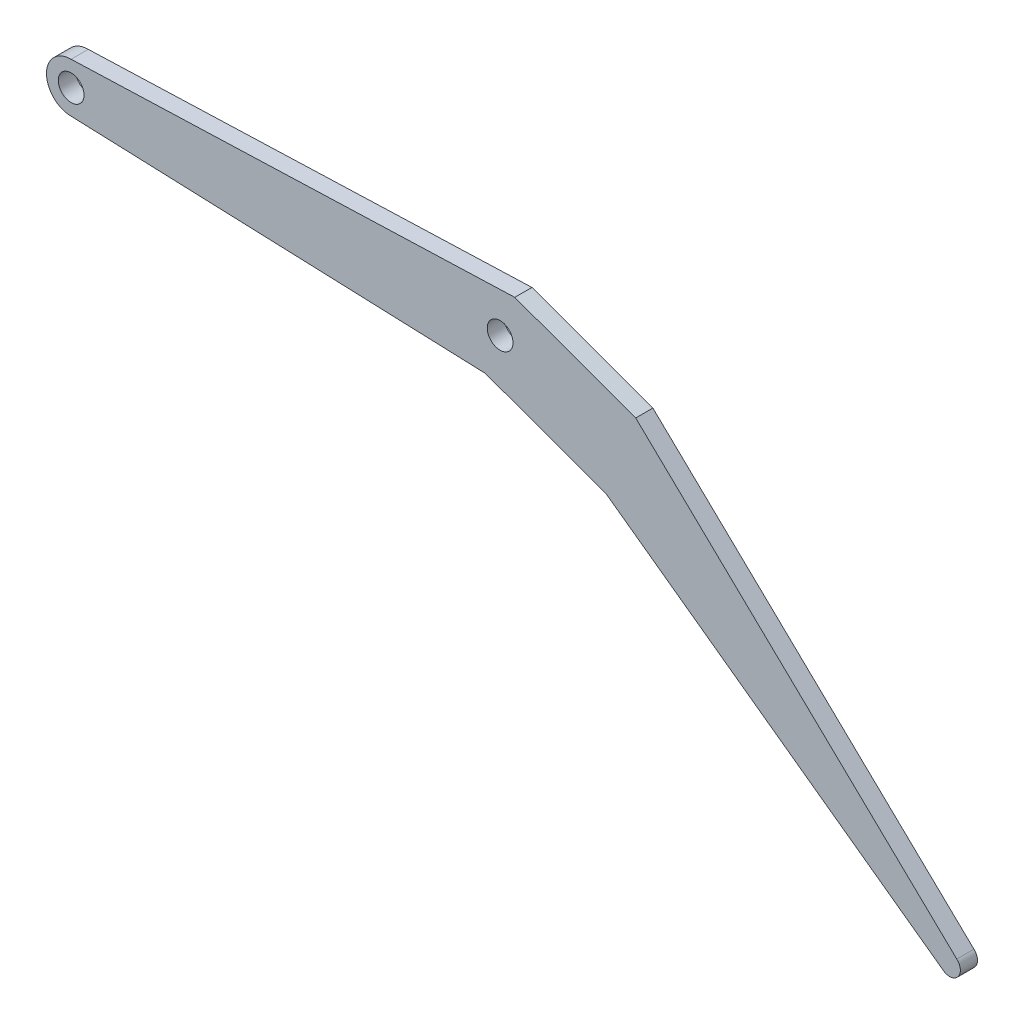
ISO-10303-21;
HEADER;
FILE_DESCRIPTION(('STEP AP214'),'2;1');
FILE_NAME('part.step','',(''),(''),'','','');
FILE_SCHEMA(('AUTOMOTIVE_DESIGN { 1 0 10303 214 1 1 1 1 }'));
ENDSEC;
DATA;
#1=APPLICATION_CONTEXT('core data for automotive mechanical design processes');
#2=APPLICATION_PROTOCOL_DEFINITION('international standard','automotive_design',2000,#1);
#3=PRODUCT_CONTEXT('',#1,'mechanical');
#4=PRODUCT('Part','Part','',(#3));
#5=PRODUCT_RELATED_PRODUCT_CATEGORY('part','',(#4));
#6=PRODUCT_DEFINITION_FORMATION('','',#4);
#7=PRODUCT_DEFINITION_CONTEXT('part definition',#1,'design');
#8=PRODUCT_DEFINITION('design','',#6,#7);
#9=PRODUCT_DEFINITION_SHAPE('','',#8);
#10=(LENGTH_UNIT() NAMED_UNIT(*) SI_UNIT(.MILLI.,.METRE.));
#11=(NAMED_UNIT(*) PLANE_ANGLE_UNIT() SI_UNIT($,.RADIAN.));
#12=(NAMED_UNIT(*) SI_UNIT($,.STERADIAN.) SOLID_ANGLE_UNIT());
#13=UNCERTAINTY_MEASURE_WITH_UNIT(LENGTH_MEASURE(1.E-05),#10,'distance_accuracy_value','');
#14=(GEOMETRIC_REPRESENTATION_CONTEXT(3) GLOBAL_UNCERTAINTY_ASSIGNED_CONTEXT((#13)) GLOBAL_UNIT_ASSIGNED_CONTEXT((#10,
#11,#12)) REPRESENTATION_CONTEXT('',''));
#15=CARTESIAN_POINT('',(0.,0.,0.));
#16=DIRECTION('',(0.,0.,1.));
#17=DIRECTION('',(1.,0.,0.));
#18=AXIS2_PLACEMENT_3D('',#15,#16,#17);
#19=CARTESIAN_POINT('',(204.795222935475,-74.5393652684242,4.));
#20=DIRECTION('',(0.,0.,-1.));
#21=DIRECTION('',(-1.,0.,0.));
#22=AXIS2_PLACEMENT_3D('',#19,#20,#21);
#23=PLANE('',#22);
#24=CARTESIAN_POINT('',(0.,0.,4.));
#25=DIRECTION('',(0.,0.,1.));
#26=DIRECTION('',(1.,0.,0.));
#27=AXIS2_PLACEMENT_3D('',#24,#25,#26);
#28=CIRCLE('',#27,3.);
#29=CARTESIAN_POINT('',(3.,0.,4.));
#30=VERTEX_POINT('',#29);
#31=EDGE_CURVE('E133',#30,#30,#28,.T.);
#32=ORIENTED_EDGE('',*,*,#31,.F.);
#33=EDGE_LOOP('',(#32));
#34=FACE_BOUND('',#33,.T.);
#35=DIRECTION('',(0.999287164546727,-0.0377513280847565,0.));
#36=VECTOR('',#35,1.);
#37=CARTESIAN_POINT('',(0.0408938314199533,-5.74985458029608,4.));
#38=LINE('',#37,#36);
#39=CARTESIAN_POINT('',(0.040893831419951,-5.74985458029608,4.));
#40=VERTEX_POINT('',#39);
#41=CARTESIAN_POINT('',(96.5797985667433,-9.39692620785908,4.));
#42=VERTEX_POINT('',#41);
#43=EDGE_CURVE('E144',#40,#42,#38,.T.);
#44=ORIENTED_EDGE('',*,*,#43,.T.);
#45=DIRECTION('',(0.939692620785908,-0.34202014332567,0.));
#46=VECTOR('',#45,1.);
#47=CARTESIAN_POINT('',(96.5797985667433,-9.39692620785908,4.));
#48=LINE('',#47,#46);
#49=CARTESIAN_POINT('',(124.770577190321,-19.6575305076292,4.));
#50=VERTEX_POINT('',#49);
#51=EDGE_CURVE('E92',#42,#50,#48,.T.);
#52=ORIENTED_EDGE('',*,*,#51,.T.);
#53=DIRECTION('',(0.809925918486021,-0.586532187151375,0.));
#54=VECTOR('',#53,1.);
#55=CARTESIAN_POINT('',(203.128908943205,-76.4030706311797,4.));
#56=LINE('',#55,#54);
#57=CARTESIAN_POINT('',(203.128908943205,-76.4030706311797,4.));
#58=VERTEX_POINT('',#57);
#59=EDGE_CURVE('E159',#50,#58,#56,.T.);
#60=ORIENTED_EDGE('',*,*,#59,.T.);
#61=CARTESIAN_POINT('',(204.795222935475,-74.5393652684242,4.));
#62=DIRECTION('',(0.,0.,1.));
#63=DIRECTION('',(-1.,0.,0.));
#64=AXIS2_PLACEMENT_3D('',#61,#62,#63);
#65=CIRCLE('',#64,2.5);
#66=CARTESIAN_POINT('',(206.461536927745,-72.6756599056686,4.));
#67=VERTEX_POINT('',#66);
#68=EDGE_CURVE('E172',#58,#67,#65,.T.);
#69=ORIENTED_EDGE('',*,*,#68,.T.);
#70=DIRECTION('',(-0.721601864645702,0.692308275943489,0.));
#71=VECTOR('',#70,1.);
#72=CARTESIAN_POINT('',(131.610980056834,-0.86367809191101,4.));
#73=LINE('',#72,#71);
#74=CARTESIAN_POINT('',(131.610980056834,-0.86367809191101,4.));
#75=VERTEX_POINT('',#74);
#76=EDGE_CURVE('E111',#67,#75,#73,.T.);
#77=ORIENTED_EDGE('',*,*,#76,.T.);
#78=DIRECTION('',(-0.939692620785908,0.34202014332567,0.));
#79=VECTOR('',#78,1.);
#80=CARTESIAN_POINT('',(103.420201433257,9.39692620785908,4.));
#81=LINE('',#80,#79);
#82=CARTESIAN_POINT('',(103.420201433257,9.39692620785908,4.));
#83=VERTEX_POINT('',#82);
#84=EDGE_CURVE('E105',#75,#83,#81,.T.);
#85=ORIENTED_EDGE('',*,*,#84,.T.);
#86=DIRECTION('',(-0.999378893993912,-0.0352395550412492,0.));
#87=VECTOR('',#86,1.);
#88=CARTESIAN_POINT('',(103.420201433257,9.39692620785908,4.));
#89=LINE('',#88,#87);
#90=CARTESIAN_POINT('',(-0.00515059593932289,5.7499976931614,4.));
#91=VERTEX_POINT('',#90);
#92=EDGE_CURVE('E109',#83,#91,#89,.T.);
#93=ORIENTED_EDGE('',*,*,#92,.T.);
#94=CARTESIAN_POINT('',(0.,0.,4.));
#95=DIRECTION('',(0.,0.,1.));
#96=DIRECTION('',(1.,0.,0.));
#97=AXIS2_PLACEMENT_3D('',#94,#95,#96);
#98=CIRCLE('',#97,5.75);
#99=EDGE_CURVE('E49',#91,#40,#98,.T.);
#100=ORIENTED_EDGE('',*,*,#99,.T.);
#101=EDGE_LOOP('',(#44,#52,#60,#69,#77,#85,#93,#100));
#102=FACE_BOUND('',#101,.T.);
#103=CARTESIAN_POINT('',(100.,0.,4.));
#104=DIRECTION('',(0.,0.,1.));
#105=DIRECTION('',(1.,0.,0.));
#106=AXIS2_PLACEMENT_3D('',#103,#104,#105);
#107=CIRCLE('',#106,3.00000000000001);
#108=CARTESIAN_POINT('',(103.,0.,4.));
#109=VERTEX_POINT('',#108);
#110=EDGE_CURVE('E181',#109,#109,#107,.T.);
#111=ORIENTED_EDGE('',*,*,#110,.F.);
#112=EDGE_LOOP('',(#111));
#113=FACE_BOUND('',#112,.T.);
#114=ADVANCED_FACE('F32',(#34,#102,#113),#23,.F.);
#115=CARTESIAN_POINT('',(204.795222935475,-74.5393652684242,0.));
#116=DIRECTION('',(0.,0.,-1.));
#117=DIRECTION('',(-1.,0.,0.));
#118=AXIS2_PLACEMENT_3D('',#115,#116,#117);
#119=PLANE('',#118);
#120=CARTESIAN_POINT('',(0.,0.,0.));
#121=DIRECTION('',(0.,0.,1.));
#122=DIRECTION('',(1.,0.,0.));
#123=AXIS2_PLACEMENT_3D('',#120,#121,#122);
#124=CIRCLE('',#123,3.);
#125=CARTESIAN_POINT('',(3.,0.,0.));
#126=VERTEX_POINT('',#125);
#127=EDGE_CURVE('E178',#126,#126,#124,.T.);
#128=ORIENTED_EDGE('',*,*,#127,.T.);
#129=EDGE_LOOP('',(#128));
#130=FACE_BOUND('',#129,.T.);
#131=DIRECTION('',(0.999287164546727,-0.0377513280847565,0.));
#132=VECTOR('',#131,1.);
#133=CARTESIAN_POINT('',(0.0408938314199533,-5.74985458029608,0.));
#134=LINE('',#133,#132);
#135=CARTESIAN_POINT('',(0.040893831419951,-5.74985458029608,0.));
#136=VERTEX_POINT('',#135);
#137=CARTESIAN_POINT('',(96.5797985667433,-9.39692620785908,0.));
#138=VERTEX_POINT('',#137);
#139=EDGE_CURVE('E129',#136,#138,#134,.T.);
#140=ORIENTED_EDGE('',*,*,#139,.F.);
#141=CARTESIAN_POINT('',(0.,0.,0.));
#142=DIRECTION('',(0.,0.,1.));
#143=DIRECTION('',(1.,0.,0.));
#144=AXIS2_PLACEMENT_3D('',#141,#142,#143);
#145=CIRCLE('',#144,5.75);
#146=CARTESIAN_POINT('',(-0.00515059593932289,5.7499976931614,0.));
#147=VERTEX_POINT('',#146);
#148=EDGE_CURVE('E84',#147,#136,#145,.T.);
#149=ORIENTED_EDGE('',*,*,#148,.F.);
#150=DIRECTION('',(-0.999378893993912,-0.0352395550412492,0.));
#151=VECTOR('',#150,1.);
#152=CARTESIAN_POINT('',(103.420201433257,9.39692620785908,0.));
#153=LINE('',#152,#151);
#154=CARTESIAN_POINT('',(103.420201433257,9.39692620785908,0.));
#155=VERTEX_POINT('',#154);
#156=EDGE_CURVE('E78',#155,#147,#153,.T.);
#157=ORIENTED_EDGE('',*,*,#156,.F.);
#158=DIRECTION('',(-0.939692620785908,0.34202014332567,0.));
#159=VECTOR('',#158,1.);
#160=CARTESIAN_POINT('',(103.420201433257,9.39692620785908,0.));
#161=LINE('',#160,#159);
#162=CARTESIAN_POINT('',(131.610980056834,-0.86367809191101,0.));
#163=VERTEX_POINT('',#162);
#164=EDGE_CURVE('E119',#163,#155,#161,.T.);
#165=ORIENTED_EDGE('',*,*,#164,.F.);
#166=DIRECTION('',(-0.721601864645702,0.692308275943489,0.));
#167=VECTOR('',#166,1.);
#168=CARTESIAN_POINT('',(131.610980056834,-0.86367809191101,0.));
#169=LINE('',#168,#167);
#170=CARTESIAN_POINT('',(206.461536927745,-72.6756599056686,0.));
#171=VERTEX_POINT('',#170);
#172=EDGE_CURVE('E139',#171,#163,#169,.T.);
#173=ORIENTED_EDGE('',*,*,#172,.F.);
#174=CARTESIAN_POINT('',(204.795222935475,-74.5393652684242,0.));
#175=DIRECTION('',(0.,0.,1.));
#176=DIRECTION('',(-1.,0.,0.));
#177=AXIS2_PLACEMENT_3D('',#174,#175,#176);
#178=CIRCLE('',#177,2.5);
#179=CARTESIAN_POINT('',(203.128908943205,-76.4030706311797,0.));
#180=VERTEX_POINT('',#179);
#181=EDGE_CURVE('E137',#180,#171,#178,.T.);
#182=ORIENTED_EDGE('',*,*,#181,.F.);
#183=DIRECTION('',(0.809925918486021,-0.586532187151375,0.));
#184=VECTOR('',#183,1.);
#185=CARTESIAN_POINT('',(203.128908943205,-76.4030706311797,0.));
#186=LINE('',#185,#184);
#187=CARTESIAN_POINT('',(124.770577190321,-19.6575305076292,0.));
#188=VERTEX_POINT('',#187);
#189=EDGE_CURVE('E135',#188,#180,#186,.T.);
#190=ORIENTED_EDGE('',*,*,#189,.F.);
#191=DIRECTION('',(0.939692620785908,-0.34202014332567,0.));
#192=VECTOR('',#191,1.);
#193=CARTESIAN_POINT('',(96.5797985667433,-9.39692620785908,0.));
#194=LINE('',#193,#192);
#195=EDGE_CURVE('E132',#138,#188,#194,.T.);
#196=ORIENTED_EDGE('',*,*,#195,.F.);
#197=EDGE_LOOP('',(#140,#149,#157,#165,#173,#182,#190,#196));
#198=FACE_BOUND('',#197,.T.);
#199=CARTESIAN_POINT('',(100.,0.,0.));
#200=DIRECTION('',(0.,0.,1.));
#201=DIRECTION('',(1.,0.,0.));
#202=AXIS2_PLACEMENT_3D('',#199,#200,#201);
#203=CIRCLE('',#202,3.00000000000001);
#204=CARTESIAN_POINT('',(103.,0.,0.));
#205=VERTEX_POINT('',#204);
#206=EDGE_CURVE('E184',#205,#205,#203,.T.);
#207=ORIENTED_EDGE('',*,*,#206,.T.);
#208=EDGE_LOOP('',(#207));
#209=FACE_BOUND('',#208,.T.);
#210=ADVANCED_FACE('F163',(#130,#198,#209),#119,.T.);
#211=CARTESIAN_POINT('',(0.0408938314199533,-5.74985458029608,4.));
#212=DIRECTION('',(0.0377513280847565,0.999287164546727,0.));
#213=DIRECTION('',(-0.999287164546727,0.0377513280847565,0.));
#214=AXIS2_PLACEMENT_3D('',#211,#212,#213);
#215=PLANE('',#214);
#216=ORIENTED_EDGE('',*,*,#139,.T.);
#217=DIRECTION('',(0.,0.,-1.));
#218=VECTOR('',#217,1.);
#219=CARTESIAN_POINT('',(96.5797985667433,-9.39692620785908,4.));
#220=LINE('',#219,#218);
#221=EDGE_CURVE('E11',#42,#138,#220,.T.);
#222=ORIENTED_EDGE('',*,*,#221,.F.);
#223=ORIENTED_EDGE('',*,*,#43,.F.);
#224=DIRECTION('',(0.,0.,-1.));
#225=VECTOR('',#224,1.);
#226=CARTESIAN_POINT('',(0.040893831419951,-5.74985458029608,4.));
#227=LINE('',#226,#225);
#228=EDGE_CURVE('E125',#40,#136,#227,.T.);
#229=ORIENTED_EDGE('',*,*,#228,.T.);
#230=EDGE_LOOP('',(#216,#222,#223,#229));
#231=FACE_BOUND('',#230,.T.);
#232=ADVANCED_FACE('F34',(#231),#215,.F.);
#233=CARTESIAN_POINT('',(96.5797985667433,-9.39692620785908,4.));
#234=DIRECTION('',(0.34202014332567,0.939692620785908,0.));
#235=DIRECTION('',(-0.939692620785908,0.34202014332567,0.));
#236=AXIS2_PLACEMENT_3D('',#233,#234,#235);
#237=PLANE('',#236);
#238=ORIENTED_EDGE('',*,*,#195,.T.);
#239=DIRECTION('',(0.,0.,-1.));
#240=VECTOR('',#239,1.);
#241=CARTESIAN_POINT('',(124.770577190321,-19.6575305076292,4.));
#242=LINE('',#241,#240);
#243=EDGE_CURVE('E41',#50,#188,#242,.T.);
#244=ORIENTED_EDGE('',*,*,#243,.F.);
#245=ORIENTED_EDGE('',*,*,#51,.F.);
#246=ORIENTED_EDGE('',*,*,#221,.T.);
#247=EDGE_LOOP('',(#238,#244,#245,#246));
#248=FACE_BOUND('',#247,.T.);
#249=ADVANCED_FACE('F217',(#248),#237,.F.);
#250=CARTESIAN_POINT('',(203.128908943205,-76.4030706311797,4.));
#251=DIRECTION('',(0.586532187151375,0.809925918486021,0.));
#252=DIRECTION('',(-0.809925918486021,0.586532187151375,0.));
#253=AXIS2_PLACEMENT_3D('',#250,#251,#252);
#254=PLANE('',#253);
#255=ORIENTED_EDGE('',*,*,#189,.T.);
#256=DIRECTION('',(0.,0.,-1.));
#257=VECTOR('',#256,1.);
#258=CARTESIAN_POINT('',(203.128908943205,-76.4030706311797,4.));
#259=LINE('',#258,#257);
#260=EDGE_CURVE('E151',#58,#180,#259,.T.);
#261=ORIENTED_EDGE('',*,*,#260,.F.);
#262=ORIENTED_EDGE('',*,*,#59,.F.);
#263=ORIENTED_EDGE('',*,*,#243,.T.);
#264=EDGE_LOOP('',(#255,#261,#262,#263));
#265=FACE_BOUND('',#264,.T.);
#266=ADVANCED_FACE('F157',(#265),#254,.F.);
#267=CARTESIAN_POINT('',(204.795222935475,-74.5393652684242,4.));
#268=DIRECTION('',(0.,0.,-1.));
#269=DIRECTION('',(-1.,0.,0.));
#270=AXIS2_PLACEMENT_3D('',#267,#268,#269);
#271=CYLINDRICAL_SURFACE('',#270,2.5);
#272=ORIENTED_EDGE('',*,*,#181,.T.);
#273=DIRECTION('',(0.,0.,-1.));
#274=VECTOR('',#273,1.);
#275=CARTESIAN_POINT('',(206.461536927745,-72.6756599056686,4.));
#276=LINE('',#275,#274);
#277=EDGE_CURVE('E148',#67,#171,#276,.T.);
#278=ORIENTED_EDGE('',*,*,#277,.F.);
#279=ORIENTED_EDGE('',*,*,#68,.F.);
#280=ORIENTED_EDGE('',*,*,#260,.T.);
#281=EDGE_LOOP('',(#272,#278,#279,#280));
#282=FACE_BOUND('',#281,.T.);
#283=ADVANCED_FACE('F168',(#282),#271,.T.);
#284=CARTESIAN_POINT('',(131.610980056834,-0.86367809191101,4.));
#285=DIRECTION('',(-0.692308275943489,-0.721601864645702,0.));
#286=DIRECTION('',(0.721601864645702,-0.692308275943489,0.));
#287=AXIS2_PLACEMENT_3D('',#284,#285,#286);
#288=PLANE('',#287);
#289=ORIENTED_EDGE('',*,*,#172,.T.);
#290=DIRECTION('',(0.,0.,-1.));
#291=VECTOR('',#290,1.);
#292=CARTESIAN_POINT('',(131.610980056834,-0.86367809191101,4.));
#293=LINE('',#292,#291);
#294=EDGE_CURVE('E120',#75,#163,#293,.T.);
#295=ORIENTED_EDGE('',*,*,#294,.F.);
#296=ORIENTED_EDGE('',*,*,#76,.F.);
#297=ORIENTED_EDGE('',*,*,#277,.T.);
#298=EDGE_LOOP('',(#289,#295,#296,#297));
#299=FACE_BOUND('',#298,.T.);
#300=ADVANCED_FACE('F171',(#299),#288,.F.);
#301=CARTESIAN_POINT('',(103.420201433257,9.39692620785908,4.));
#302=DIRECTION('',(-0.34202014332567,-0.939692620785908,0.));
#303=DIRECTION('',(0.939692620785908,-0.34202014332567,0.));
#304=AXIS2_PLACEMENT_3D('',#301,#302,#303);
#305=PLANE('',#304);
#306=ORIENTED_EDGE('',*,*,#164,.T.);
#307=DIRECTION('',(0.,0.,-1.));
#308=VECTOR('',#307,1.);
#309=CARTESIAN_POINT('',(103.420201433257,9.39692620785908,4.));
#310=LINE('',#309,#308);
#311=EDGE_CURVE('E116',#83,#155,#310,.T.);
#312=ORIENTED_EDGE('',*,*,#311,.F.);
#313=ORIENTED_EDGE('',*,*,#84,.F.);
#314=ORIENTED_EDGE('',*,*,#294,.T.);
#315=EDGE_LOOP('',(#306,#312,#313,#314));
#316=FACE_BOUND('',#315,.T.);
#317=ADVANCED_FACE('F117',(#316),#305,.F.);
#318=CARTESIAN_POINT('',(103.420201433257,9.39692620785908,4.));
#319=DIRECTION('',(0.0352395550412492,-0.999378893993912,0.));
#320=DIRECTION('',(0.999378893993912,0.0352395550412492,0.));
#321=AXIS2_PLACEMENT_3D('',#318,#319,#320);
#322=PLANE('',#321);
#323=ORIENTED_EDGE('',*,*,#156,.T.);
#324=DIRECTION('',(0.,0.,-1.));
#325=VECTOR('',#324,1.);
#326=CARTESIAN_POINT('',(-0.00515059593932289,5.7499976931614,4.));
#327=LINE('',#326,#325);
#328=EDGE_CURVE('E121',#91,#147,#327,.T.);
#329=ORIENTED_EDGE('',*,*,#328,.F.);
#330=ORIENTED_EDGE('',*,*,#92,.F.);
#331=ORIENTED_EDGE('',*,*,#311,.T.);
#332=EDGE_LOOP('',(#323,#329,#330,#331));
#333=FACE_BOUND('',#332,.T.);
#334=ADVANCED_FACE('F123',(#333),#322,.F.);
#335=CARTESIAN_POINT('',(0.,0.,4.));
#336=DIRECTION('',(0.,0.,-1.));
#337=DIRECTION('',(-1.,0.,0.));
#338=AXIS2_PLACEMENT_3D('',#335,#336,#337);
#339=CYLINDRICAL_SURFACE('',#338,5.75);
#340=ORIENTED_EDGE('',*,*,#148,.T.);
#341=ORIENTED_EDGE('',*,*,#228,.F.);
#342=ORIENTED_EDGE('',*,*,#99,.F.);
#343=ORIENTED_EDGE('',*,*,#328,.T.);
#344=EDGE_LOOP('',(#340,#341,#342,#343));
#345=FACE_BOUND('',#344,.T.);
#346=ADVANCED_FACE('F205',(#345),#339,.T.);
#347=CARTESIAN_POINT('',(0.,0.,4.));
#348=DIRECTION('',(0.,0.,-1.));
#349=DIRECTION('',(-1.,0.,0.));
#350=AXIS2_PLACEMENT_3D('',#347,#348,#349);
#351=CYLINDRICAL_SURFACE('',#350,3.);
#352=ORIENTED_EDGE('',*,*,#31,.T.);
#353=EDGE_LOOP('',(#352));
#354=FACE_BOUND('',#353,.T.);
#355=ORIENTED_EDGE('',*,*,#127,.F.);
#356=EDGE_LOOP('',(#355));
#357=FACE_BOUND('',#356,.T.);
#358=ADVANCED_FACE('F202',(#354,#357),#351,.F.);
#359=CARTESIAN_POINT('',(100.,0.,4.));
#360=DIRECTION('',(0.,0.,-1.));
#361=DIRECTION('',(-1.,0.,0.));
#362=AXIS2_PLACEMENT_3D('',#359,#360,#361);
#363=CYLINDRICAL_SURFACE('',#362,3.00000000000001);
#364=ORIENTED_EDGE('',*,*,#110,.T.);
#365=EDGE_LOOP('',(#364));
#366=FACE_BOUND('',#365,.T.);
#367=ORIENTED_EDGE('',*,*,#206,.F.);
#368=EDGE_LOOP('',(#367));
#369=FACE_BOUND('',#368,.T.);
#370=ADVANCED_FACE('F190',(#366,#369),#363,.F.);
#371=CLOSED_SHELL('',(#114,#210,#232,#249,#266,#283,#300,#317,#334,#346,#358,#370));
#372=MANIFOLD_SOLID_BREP('B2',#371);
#373=ADVANCED_BREP_SHAPE_REPRESENTATION('',(#18,#372),#14);
#374=SHAPE_DEFINITION_REPRESENTATION(#9,#373);
ENDSEC;
END-ISO-10303-21;
